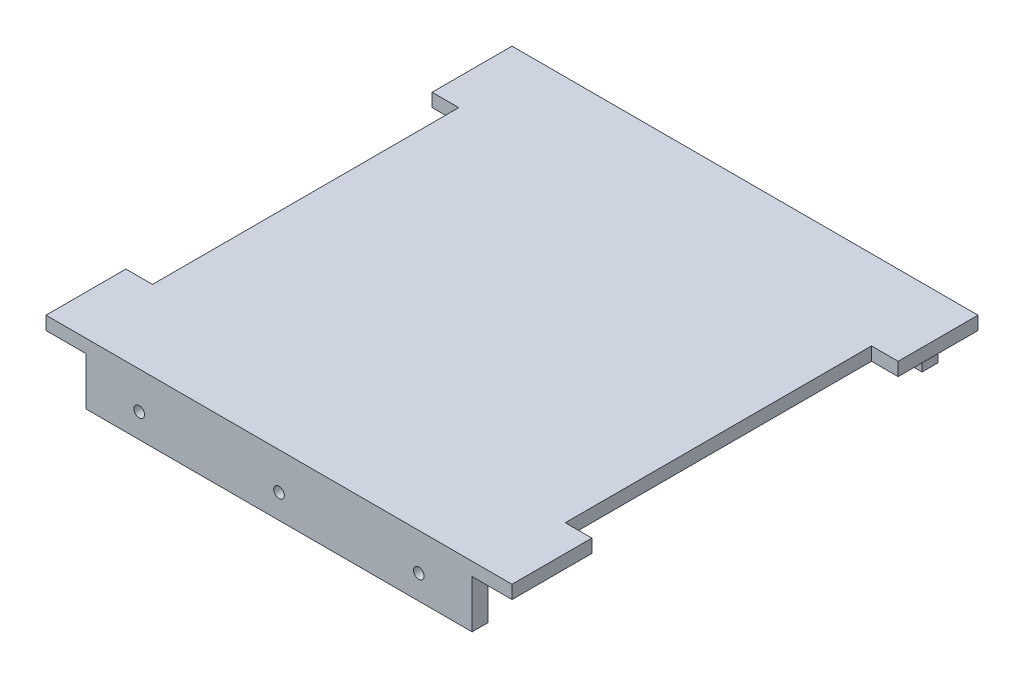
ISO-10303-21;
HEADER;
FILE_DESCRIPTION(('STEP AP214'),'2;1');
FILE_NAME('part.step','',(''),(''),'','','');
FILE_SCHEMA(('AUTOMOTIVE_DESIGN { 1 0 10303 214 1 1 1 1 }'));
ENDSEC;
DATA;
#1=APPLICATION_CONTEXT('core data for automotive mechanical design processes');
#2=APPLICATION_PROTOCOL_DEFINITION('international standard','automotive_design',2000,#1);
#3=PRODUCT_CONTEXT('',#1,'mechanical');
#4=PRODUCT('Part','Part','',(#3));
#5=PRODUCT_RELATED_PRODUCT_CATEGORY('part','',(#4));
#6=PRODUCT_DEFINITION_FORMATION('','',#4);
#7=PRODUCT_DEFINITION_CONTEXT('part definition',#1,'design');
#8=PRODUCT_DEFINITION('design','',#6,#7);
#9=PRODUCT_DEFINITION_SHAPE('','',#8);
#10=(LENGTH_UNIT() NAMED_UNIT(*) SI_UNIT(.MILLI.,.METRE.));
#11=(NAMED_UNIT(*) PLANE_ANGLE_UNIT() SI_UNIT($,.RADIAN.));
#12=(NAMED_UNIT(*) SI_UNIT($,.STERADIAN.) SOLID_ANGLE_UNIT());
#13=UNCERTAINTY_MEASURE_WITH_UNIT(LENGTH_MEASURE(1.E-05),#10,'distance_accuracy_value','');
#14=(GEOMETRIC_REPRESENTATION_CONTEXT(3) GLOBAL_UNCERTAINTY_ASSIGNED_CONTEXT((#13)) GLOBAL_UNIT_ASSIGNED_CONTEXT((#10,
#11,#12)) REPRESENTATION_CONTEXT('',''));
#15=CARTESIAN_POINT('',(0.,0.,0.));
#16=DIRECTION('',(0.,0.,1.));
#17=DIRECTION('',(1.,0.,0.));
#18=AXIS2_PLACEMENT_3D('',#15,#16,#17);
#19=CARTESIAN_POINT('',(-111.545801526718,5.,-60.1145038167939));
#20=DIRECTION('',(1.,0.,0.));
#21=DIRECTION('',(0.,0.,-1.));
#22=AXIS2_PLACEMENT_3D('',#19,#20,#21);
#23=PLANE('',#22);
#24=DIRECTION('',(0.,0.,1.));
#25=VECTOR('',#24,1.);
#26=CARTESIAN_POINT('',(-111.545801526718,0.,-60.1145038167939));
#27=LINE('',#26,#25);
#28=CARTESIAN_POINT('',(-111.545801526718,0.,-60.1145038167939));
#29=VERTEX_POINT('',#28);
#30=CARTESIAN_POINT('',(-111.545801526718,0.,-30.1145038167939));
#31=VERTEX_POINT('',#30);
#32=EDGE_CURVE('E329',#29,#31,#27,.T.);
#33=ORIENTED_EDGE('',*,*,#32,.T.);
#34=DIRECTION('',(0.,1.,0.));
#35=VECTOR('',#34,1.);
#36=CARTESIAN_POINT('',(-111.545801526718,-5.,-30.1145038167939));
#37=LINE('',#36,#35);
#38=CARTESIAN_POINT('',(-111.545801526718,5.,-30.1145038167939));
#39=VERTEX_POINT('',#38);
#40=EDGE_CURVE('E197',#31,#39,#37,.T.);
#41=ORIENTED_EDGE('',*,*,#40,.T.);
#42=DIRECTION('',(0.,0.,1.));
#43=VECTOR('',#42,1.);
#44=CARTESIAN_POINT('',(-111.545801526718,5.,-60.1145038167939));
#45=LINE('',#44,#43);
#46=CARTESIAN_POINT('',(-111.545801526718,5.,-60.1145038167939));
#47=VERTEX_POINT('',#46);
#48=EDGE_CURVE('E317',#47,#39,#45,.T.);
#49=ORIENTED_EDGE('',*,*,#48,.F.);
#50=DIRECTION('',(0.,-1.,0.));
#51=VECTOR('',#50,1.);
#52=CARTESIAN_POINT('',(-111.545801526718,5.,-60.1145038167939));
#53=LINE('',#52,#51);
#54=EDGE_CURVE('E328',#47,#29,#53,.T.);
#55=ORIENTED_EDGE('',*,*,#54,.T.);
#56=EDGE_LOOP('',(#33,#41,#49,#55));
#57=FACE_BOUND('',#56,.T.);
#58=ADVANCED_FACE('F33',(#57),#23,.F.);
#59=CARTESIAN_POINT('',(63.4541984732824,5.,-60.1145038167939));
#60=DIRECTION('',(-1.,0.,0.));
#61=DIRECTION('',(0.,0.,1.));
#62=AXIS2_PLACEMENT_3D('',#59,#60,#61);
#63=PLANE('',#62);
#64=DIRECTION('',(0.,0.,-1.));
#65=VECTOR('',#64,1.);
#66=CARTESIAN_POINT('',(63.4541984732824,0.,-60.1145038167939));
#67=LINE('',#66,#65);
#68=CARTESIAN_POINT('',(63.4541984732824,0.,114.885496183206));
#69=VERTEX_POINT('',#68);
#70=CARTESIAN_POINT('',(63.4541984732824,0.,84.8854961832061));
#71=VERTEX_POINT('',#70);
#72=EDGE_CURVE('E337',#69,#71,#67,.T.);
#73=ORIENTED_EDGE('',*,*,#72,.T.);
#74=DIRECTION('',(0.,1.,0.));
#75=VECTOR('',#74,1.);
#76=CARTESIAN_POINT('',(63.4541984732824,-5.,84.8854961832061));
#77=LINE('',#76,#75);
#78=CARTESIAN_POINT('',(63.4541984732824,5.,84.8854961832061));
#79=VERTEX_POINT('',#78);
#80=EDGE_CURVE('E189',#71,#79,#77,.T.);
#81=ORIENTED_EDGE('',*,*,#80,.T.);
#82=DIRECTION('',(0.,0.,-1.));
#83=VECTOR('',#82,1.);
#84=CARTESIAN_POINT('',(63.4541984732824,5.,-60.1145038167939));
#85=LINE('',#84,#83);
#86=CARTESIAN_POINT('',(63.4541984732824,5.,114.885496183206));
#87=VERTEX_POINT('',#86);
#88=EDGE_CURVE('E323',#87,#79,#85,.T.);
#89=ORIENTED_EDGE('',*,*,#88,.F.);
#90=DIRECTION('',(0.,-1.,0.));
#91=VECTOR('',#90,1.);
#92=CARTESIAN_POINT('',(63.4541984732824,5.,114.885496183206));
#93=LINE('',#92,#91);
#94=EDGE_CURVE('E42',#87,#69,#93,.T.);
#95=ORIENTED_EDGE('',*,*,#94,.T.);
#96=EDGE_LOOP('',(#73,#81,#89,#95));
#97=FACE_BOUND('',#96,.T.);
#98=ADVANCED_FACE('F408',(#97),#63,.F.);
#99=CARTESIAN_POINT('',(0.,0.,0.));
#100=DIRECTION('',(0.,1.,0.));
#101=DIRECTION('',(0.,0.,1.));
#102=AXIS2_PLACEMENT_3D('',#99,#100,#101);
#103=PLANE('',#102);
#104=DIRECTION('',(0.,0.,-1.));
#105=VECTOR('',#104,1.);
#106=CARTESIAN_POINT('',(-101.545801526718,0.,0.));
#107=LINE('',#106,#105);
#108=CARTESIAN_POINT('',(-101.545801526718,0.,84.8854961832061));
#109=VERTEX_POINT('',#108);
#110=CARTESIAN_POINT('',(-101.545801526718,0.,-30.1145038167939));
#111=VERTEX_POINT('',#110);
#112=EDGE_CURVE('E181',#109,#111,#107,.T.);
#113=ORIENTED_EDGE('',*,*,#112,.T.);
#114=DIRECTION('',(-1.,0.,0.));
#115=VECTOR('',#114,1.);
#116=CARTESIAN_POINT('',(0.,0.,-30.1145038167939));
#117=LINE('',#116,#115);
#118=EDGE_CURVE('E228',#111,#31,#117,.T.);
#119=ORIENTED_EDGE('',*,*,#118,.T.);
#120=ORIENTED_EDGE('',*,*,#32,.F.);
#121=DIRECTION('',(-1.,0.,0.));
#122=VECTOR('',#121,1.);
#123=CARTESIAN_POINT('',(-111.545801526718,0.,-60.1145038167939));
#124=LINE('',#123,#122);
#125=CARTESIAN_POINT('',(-96.5458015267176,0.,-60.1145038167939));
#126=VERTEX_POINT('',#125);
#127=EDGE_CURVE('E340',#126,#29,#124,.T.);
#128=ORIENTED_EDGE('',*,*,#127,.F.);
#129=DIRECTION('',(0.,0.,-1.));
#130=VECTOR('',#129,1.);
#131=CARTESIAN_POINT('',(-96.5458015267176,0.,-60.1145038167939));
#132=LINE('',#131,#130);
#133=CARTESIAN_POINT('',(-96.5458015267176,0.,-54.1145038167939));
#134=VERTEX_POINT('',#133);
#135=EDGE_CURVE('E260',#134,#126,#132,.T.);
#136=ORIENTED_EDGE('',*,*,#135,.F.);
#137=DIRECTION('',(-1.,0.,0.));
#138=VECTOR('',#137,1.);
#139=CARTESIAN_POINT('',(-96.5458015267176,0.,-54.1145038167939));
#140=LINE('',#139,#138);
#141=CARTESIAN_POINT('',(48.4541984732824,0.,-54.1145038167939));
#142=VERTEX_POINT('',#141);
#143=EDGE_CURVE('E265',#142,#134,#140,.T.);
#144=ORIENTED_EDGE('',*,*,#143,.F.);
#145=DIRECTION('',(0.,0.,1.));
#146=VECTOR('',#145,1.);
#147=CARTESIAN_POINT('',(48.4541984732824,0.,-60.1145038167939));
#148=LINE('',#147,#146);
#149=CARTESIAN_POINT('',(48.4541984732824,0.,-60.1145038167939));
#150=VERTEX_POINT('',#149);
#151=EDGE_CURVE('E273',#150,#142,#148,.T.);
#152=ORIENTED_EDGE('',*,*,#151,.F.);
#153=CARTESIAN_POINT('',(63.4541984732824,0.,-60.1145038167939));
#154=VERTEX_POINT('',#153);
#155=EDGE_CURVE('E341',#154,#150,#124,.T.);
#156=ORIENTED_EDGE('',*,*,#155,.F.);
#157=CARTESIAN_POINT('',(63.4541984732824,0.,-30.1145038167939));
#158=VERTEX_POINT('',#157);
#159=EDGE_CURVE('E336',#158,#154,#67,.T.);
#160=ORIENTED_EDGE('',*,*,#159,.F.);
#161=DIRECTION('',(-1.,0.,0.));
#162=VECTOR('',#161,1.);
#163=CARTESIAN_POINT('',(0.,0.,-30.1145038167939));
#164=LINE('',#163,#162);
#165=CARTESIAN_POINT('',(53.4541984732824,0.,-30.1145038167939));
#166=VERTEX_POINT('',#165);
#167=EDGE_CURVE('E200',#158,#166,#164,.T.);
#168=ORIENTED_EDGE('',*,*,#167,.T.);
#169=DIRECTION('',(0.,0.,1.));
#170=VECTOR('',#169,1.);
#171=CARTESIAN_POINT('',(53.4541984732824,0.,0.));
#172=LINE('',#171,#170);
#173=CARTESIAN_POINT('',(53.4541984732824,0.,84.8854961832061));
#174=VERTEX_POINT('',#173);
#175=EDGE_CURVE('E219',#166,#174,#172,.T.);
#176=ORIENTED_EDGE('',*,*,#175,.T.);
#177=DIRECTION('',(1.,0.,0.));
#178=VECTOR('',#177,1.);
#179=CARTESIAN_POINT('',(0.,0.,84.8854961832061));
#180=LINE('',#179,#178);
#181=EDGE_CURVE('E222',#174,#71,#180,.T.);
#182=ORIENTED_EDGE('',*,*,#181,.T.);
#183=ORIENTED_EDGE('',*,*,#72,.F.);
#184=DIRECTION('',(1.,0.,0.));
#185=VECTOR('',#184,1.);
#186=CARTESIAN_POINT('',(-111.545801526718,0.,114.885496183206));
#187=LINE('',#186,#185);
#188=CARTESIAN_POINT('',(48.4541984732824,0.,114.885496183206));
#189=VERTEX_POINT('',#188);
#190=EDGE_CURVE('E332',#189,#69,#187,.T.);
#191=ORIENTED_EDGE('',*,*,#190,.F.);
#192=DIRECTION('',(0.,0.,1.));
#193=VECTOR('',#192,1.);
#194=CARTESIAN_POINT('',(48.4541984732824,0.,114.885496183206));
#195=LINE('',#194,#193);
#196=CARTESIAN_POINT('',(48.4541984732824,0.,108.885496183206));
#197=VERTEX_POINT('',#196);
#198=EDGE_CURVE('E291',#197,#189,#195,.T.);
#199=ORIENTED_EDGE('',*,*,#198,.F.);
#200=DIRECTION('',(1.,0.,0.));
#201=VECTOR('',#200,1.);
#202=CARTESIAN_POINT('',(-96.5458015267176,0.,108.885496183206));
#203=LINE('',#202,#201);
#204=CARTESIAN_POINT('',(-96.5458015267176,0.,108.885496183206));
#205=VERTEX_POINT('',#204);
#206=EDGE_CURVE('E300',#205,#197,#203,.T.);
#207=ORIENTED_EDGE('',*,*,#206,.F.);
#208=DIRECTION('',(0.,0.,-1.));
#209=VECTOR('',#208,1.);
#210=CARTESIAN_POINT('',(-96.5458015267176,0.,114.885496183206));
#211=LINE('',#210,#209);
#212=CARTESIAN_POINT('',(-96.5458015267176,0.,114.885496183206));
#213=VERTEX_POINT('',#212);
#214=EDGE_CURVE('E286',#213,#205,#211,.T.);
#215=ORIENTED_EDGE('',*,*,#214,.F.);
#216=CARTESIAN_POINT('',(-111.545801526718,0.,114.885496183206));
#217=VERTEX_POINT('',#216);
#218=EDGE_CURVE('E333',#217,#213,#187,.T.);
#219=ORIENTED_EDGE('',*,*,#218,.F.);
#220=CARTESIAN_POINT('',(-111.545801526718,0.,84.8854961832061));
#221=VERTEX_POINT('',#220);
#222=EDGE_CURVE('E316',#221,#217,#27,.T.);
#223=ORIENTED_EDGE('',*,*,#222,.F.);
#224=DIRECTION('',(1.,0.,0.));
#225=VECTOR('',#224,1.);
#226=CARTESIAN_POINT('',(0.,0.,84.8854961832061));
#227=LINE('',#226,#225);
#228=EDGE_CURVE('E225',#221,#109,#227,.T.);
#229=ORIENTED_EDGE('',*,*,#228,.T.);
#230=EDGE_LOOP('',(#113,#119,#120,#128,#136,#144,#152,#156,#160,#168,#176,#182,#183,#191,#199,
#207,#215,#219,#223,#229));
#231=FACE_BOUND('',#230,.T.);
#232=ADVANCED_FACE('F383',(#231),#103,.F.);
#233=CARTESIAN_POINT('',(-111.545801526718,5.,84.8854961832061));
#234=VERTEX_POINT('',#233);
#235=CARTESIAN_POINT('',(-111.545801526718,5.,114.885496183206));
#236=VERTEX_POINT('',#235);
#237=EDGE_CURVE('E320',#234,#236,#45,.T.);
#238=ORIENTED_EDGE('',*,*,#237,.F.);
#239=DIRECTION('',(0.,1.,0.));
#240=VECTOR('',#239,1.);
#241=CARTESIAN_POINT('',(-111.545801526718,-5.,84.8854961832061));
#242=LINE('',#241,#240);
#243=EDGE_CURVE('E58',#221,#234,#242,.T.);
#244=ORIENTED_EDGE('',*,*,#243,.F.);
#245=ORIENTED_EDGE('',*,*,#222,.T.);
#246=DIRECTION('',(0.,-1.,0.));
#247=VECTOR('',#246,1.);
#248=CARTESIAN_POINT('',(-111.545801526718,5.,114.885496183206));
#249=LINE('',#248,#247);
#250=EDGE_CURVE('E11',#236,#217,#249,.T.);
#251=ORIENTED_EDGE('',*,*,#250,.F.);
#252=EDGE_LOOP('',(#238,#244,#245,#251));
#253=FACE_BOUND('',#252,.T.);
#254=ADVANCED_FACE('F35',(#253),#23,.F.);
#255=CARTESIAN_POINT('',(-111.545801526718,5.,114.885496183206));
#256=DIRECTION('',(0.,0.,-1.));
#257=DIRECTION('',(-1.,0.,0.));
#258=AXIS2_PLACEMENT_3D('',#255,#256,#257);
#259=PLANE('',#258);
#260=CARTESIAN_POINT('',(28.4541984732824,-8.90083287186272,114.885496183206));
#261=DIRECTION('',(0.,0.,-1.));
#262=DIRECTION('',(-1.,0.,0.));
#263=AXIS2_PLACEMENT_3D('',#260,#261,#262);
#264=CIRCLE('',#263,2.);
#265=CARTESIAN_POINT('',(26.4541984732824,-8.90083287186272,114.885496183206));
#266=VERTEX_POINT('',#265);
#267=EDGE_CURVE('E232',#266,#266,#264,.T.);
#268=ORIENTED_EDGE('',*,*,#267,.T.);
#269=EDGE_LOOP('',(#268));
#270=FACE_BOUND('',#269,.T.);
#271=CARTESIAN_POINT('',(-24.0458015267176,-8.90083287186272,114.885496183206));
#272=DIRECTION('',(0.,0.,-1.));
#273=DIRECTION('',(-1.,0.,0.));
#274=AXIS2_PLACEMENT_3D('',#271,#272,#273);
#275=CIRCLE('',#274,2.);
#276=CARTESIAN_POINT('',(-26.0458015267176,-8.90083287186272,114.885496183206));
#277=VERTEX_POINT('',#276);
#278=EDGE_CURVE('E236',#277,#277,#275,.T.);
#279=ORIENTED_EDGE('',*,*,#278,.T.);
#280=EDGE_LOOP('',(#279));
#281=FACE_BOUND('',#280,.T.);
#282=CARTESIAN_POINT('',(-76.5458015267176,-8.90083287186272,114.885496183206));
#283=DIRECTION('',(0.,0.,-1.));
#284=DIRECTION('',(-1.,0.,0.));
#285=AXIS2_PLACEMENT_3D('',#282,#283,#284);
#286=CIRCLE('',#285,2.);
#287=CARTESIAN_POINT('',(-78.5458015267176,-8.90083287186272,114.885496183206));
#288=VERTEX_POINT('',#287);
#289=EDGE_CURVE('E231',#288,#288,#286,.T.);
#290=ORIENTED_EDGE('',*,*,#289,.T.);
#291=EDGE_LOOP('',(#290));
#292=FACE_BOUND('',#291,.T.);
#293=ORIENTED_EDGE('',*,*,#218,.T.);
#294=DIRECTION('',(0.,1.,0.));
#295=VECTOR('',#294,1.);
#296=CARTESIAN_POINT('',(-96.5458015267176,-18.,114.885496183206));
#297=LINE('',#296,#295);
#298=CARTESIAN_POINT('',(-96.5458015267176,-18.,114.885496183206));
#299=VERTEX_POINT('',#298);
#300=EDGE_CURVE('E297',#299,#213,#297,.T.);
#301=ORIENTED_EDGE('',*,*,#300,.F.);
#302=DIRECTION('',(-1.,0.,0.));
#303=VECTOR('',#302,1.);
#304=CARTESIAN_POINT('',(-96.5458015267176,-18.,114.885496183206));
#305=LINE('',#304,#303);
#306=CARTESIAN_POINT('',(48.4541984732824,-18.,114.885496183206));
#307=VERTEX_POINT('',#306);
#308=EDGE_CURVE('E295',#307,#299,#305,.T.);
#309=ORIENTED_EDGE('',*,*,#308,.F.);
#310=DIRECTION('',(0.,1.,0.));
#311=VECTOR('',#310,1.);
#312=CARTESIAN_POINT('',(48.4541984732824,-18.,114.885496183206));
#313=LINE('',#312,#311);
#314=EDGE_CURVE('E307',#307,#189,#313,.T.);
#315=ORIENTED_EDGE('',*,*,#314,.T.);
#316=ORIENTED_EDGE('',*,*,#190,.T.);
#317=ORIENTED_EDGE('',*,*,#94,.F.);
#318=DIRECTION('',(1.,0.,0.));
#319=VECTOR('',#318,1.);
#320=CARTESIAN_POINT('',(-111.545801526718,5.,114.885496183206));
#321=LINE('',#320,#319);
#322=EDGE_CURVE('E319',#236,#87,#321,.T.);
#323=ORIENTED_EDGE('',*,*,#322,.F.);
#324=ORIENTED_EDGE('',*,*,#250,.T.);
#325=EDGE_LOOP('',(#293,#301,#309,#315,#316,#317,#323,#324));
#326=FACE_BOUND('',#325,.T.);
#327=ADVANCED_FACE('F406',(#270,#281,#292,#326),#259,.F.);
#328=CARTESIAN_POINT('',(63.4541984732824,5.,-30.1145038167939));
#329=VERTEX_POINT('',#328);
#330=CARTESIAN_POINT('',(63.4541984732824,5.,-60.1145038167939));
#331=VERTEX_POINT('',#330);
#332=EDGE_CURVE('E322',#329,#331,#85,.T.);
#333=ORIENTED_EDGE('',*,*,#332,.F.);
#334=DIRECTION('',(0.,1.,0.));
#335=VECTOR('',#334,1.);
#336=CARTESIAN_POINT('',(63.4541984732824,-5.,-30.1145038167939));
#337=LINE('',#336,#335);
#338=EDGE_CURVE('E50',#158,#329,#337,.T.);
#339=ORIENTED_EDGE('',*,*,#338,.F.);
#340=ORIENTED_EDGE('',*,*,#159,.T.);
#341=DIRECTION('',(0.,-1.,0.));
#342=VECTOR('',#341,1.);
#343=CARTESIAN_POINT('',(63.4541984732824,5.,-60.1145038167939));
#344=LINE('',#343,#342);
#345=EDGE_CURVE('E346',#331,#154,#344,.T.);
#346=ORIENTED_EDGE('',*,*,#345,.F.);
#347=EDGE_LOOP('',(#333,#339,#340,#346));
#348=FACE_BOUND('',#347,.T.);
#349=ADVANCED_FACE('F370',(#348),#63,.F.);
#350=CARTESIAN_POINT('',(-111.545801526718,5.,-60.1145038167939));
#351=DIRECTION('',(0.,0.,1.));
#352=DIRECTION('',(1.,0.,0.));
#353=AXIS2_PLACEMENT_3D('',#350,#351,#352);
#354=PLANE('',#353);
#355=CARTESIAN_POINT('',(28.4541984732824,-8.90083287186272,-60.1145038167939));
#356=DIRECTION('',(0.,0.,1.));
#357=DIRECTION('',(1.,0.,0.));
#358=AXIS2_PLACEMENT_3D('',#355,#356,#357);
#359=CIRCLE('',#358,2.);
#360=CARTESIAN_POINT('',(30.4541984732824,-8.90083287186272,-60.1145038167939));
#361=VERTEX_POINT('',#360);
#362=EDGE_CURVE('E257',#361,#361,#359,.T.);
#363=ORIENTED_EDGE('',*,*,#362,.T.);
#364=EDGE_LOOP('',(#363));
#365=FACE_BOUND('',#364,.T.);
#366=CARTESIAN_POINT('',(-24.0458015267176,-8.90083287186272,-60.1145038167939));
#367=DIRECTION('',(0.,0.,1.));
#368=DIRECTION('',(1.,0.,0.));
#369=AXIS2_PLACEMENT_3D('',#366,#367,#368);
#370=CIRCLE('',#369,2.);
#371=CARTESIAN_POINT('',(-22.0458015267176,-8.90083287186272,-60.1145038167939));
#372=VERTEX_POINT('',#371);
#373=EDGE_CURVE('E251',#372,#372,#370,.T.);
#374=ORIENTED_EDGE('',*,*,#373,.T.);
#375=EDGE_LOOP('',(#374));
#376=FACE_BOUND('',#375,.T.);
#377=CARTESIAN_POINT('',(-76.5458015267176,-8.90083287186272,-60.1145038167939));
#378=DIRECTION('',(0.,0.,1.));
#379=DIRECTION('',(1.,0.,0.));
#380=AXIS2_PLACEMENT_3D('',#377,#378,#379);
#381=CIRCLE('',#380,2.);
#382=CARTESIAN_POINT('',(-74.5458015267176,-8.90083287186272,-60.1145038167939));
#383=VERTEX_POINT('',#382);
#384=EDGE_CURVE('E244',#383,#383,#381,.T.);
#385=ORIENTED_EDGE('',*,*,#384,.T.);
#386=EDGE_LOOP('',(#385));
#387=FACE_BOUND('',#386,.T.);
#388=ORIENTED_EDGE('',*,*,#155,.T.);
#389=DIRECTION('',(0.,1.,0.));
#390=VECTOR('',#389,1.);
#391=CARTESIAN_POINT('',(48.4541984732824,-18.,-60.1145038167939));
#392=LINE('',#391,#390);
#393=CARTESIAN_POINT('',(48.4541984732824,-18.,-60.1145038167939));
#394=VERTEX_POINT('',#393);
#395=EDGE_CURVE('E281',#394,#150,#392,.T.);
#396=ORIENTED_EDGE('',*,*,#395,.F.);
#397=DIRECTION('',(1.,0.,0.));
#398=VECTOR('',#397,1.);
#399=CARTESIAN_POINT('',(-96.5458015267176,-18.,-60.1145038167939));
#400=LINE('',#399,#398);
#401=CARTESIAN_POINT('',(-96.5458015267176,-18.,-60.1145038167939));
#402=VERTEX_POINT('',#401);
#403=EDGE_CURVE('E264',#402,#394,#400,.T.);
#404=ORIENTED_EDGE('',*,*,#403,.F.);
#405=DIRECTION('',(0.,1.,0.));
#406=VECTOR('',#405,1.);
#407=CARTESIAN_POINT('',(-96.5458015267176,-18.,-60.1145038167939));
#408=LINE('',#407,#406);
#409=EDGE_CURVE('E283',#402,#126,#408,.T.);
#410=ORIENTED_EDGE('',*,*,#409,.T.);
#411=ORIENTED_EDGE('',*,*,#127,.T.);
#412=ORIENTED_EDGE('',*,*,#54,.F.);
#413=DIRECTION('',(-1.,0.,0.));
#414=VECTOR('',#413,1.);
#415=CARTESIAN_POINT('',(-111.545801526718,5.,-60.1145038167939));
#416=LINE('',#415,#414);
#417=EDGE_CURVE('E326',#331,#47,#416,.T.);
#418=ORIENTED_EDGE('',*,*,#417,.F.);
#419=ORIENTED_EDGE('',*,*,#345,.T.);
#420=EDGE_LOOP('',(#388,#396,#404,#410,#411,#412,#418,#419));
#421=FACE_BOUND('',#420,.T.);
#422=ADVANCED_FACE('F367',(#365,#376,#387,#421),#354,.F.);
#423=CARTESIAN_POINT('',(0.,5.,0.));
#424=DIRECTION('',(0.,1.,0.));
#425=DIRECTION('',(0.,0.,1.));
#426=AXIS2_PLACEMENT_3D('',#423,#424,#425);
#427=PLANE('',#426);
#428=DIRECTION('',(-1.,0.,0.));
#429=VECTOR('',#428,1.);
#430=CARTESIAN_POINT('',(-111.545801526718,5.,-30.1145038167939));
#431=LINE('',#430,#429);
#432=CARTESIAN_POINT('',(-101.545801526718,5.,-30.1145038167939));
#433=VERTEX_POINT('',#432);
#434=EDGE_CURVE('E193',#433,#39,#431,.T.);
#435=ORIENTED_EDGE('',*,*,#434,.F.);
#436=DIRECTION('',(0.,0.,-1.));
#437=VECTOR('',#436,1.);
#438=CARTESIAN_POINT('',(-101.545801526718,5.,-30.1145038167939));
#439=LINE('',#438,#437);
#440=CARTESIAN_POINT('',(-101.545801526718,5.,84.8854961832061));
#441=VERTEX_POINT('',#440);
#442=EDGE_CURVE('E178',#441,#433,#439,.T.);
#443=ORIENTED_EDGE('',*,*,#442,.F.);
#444=DIRECTION('',(1.,0.,0.));
#445=VECTOR('',#444,1.);
#446=CARTESIAN_POINT('',(-111.545801526718,5.,84.8854961832061));
#447=LINE('',#446,#445);
#448=EDGE_CURVE('E185',#234,#441,#447,.T.);
#449=ORIENTED_EDGE('',*,*,#448,.F.);
#450=ORIENTED_EDGE('',*,*,#237,.T.);
#451=ORIENTED_EDGE('',*,*,#322,.T.);
#452=ORIENTED_EDGE('',*,*,#88,.T.);
#453=DIRECTION('',(1.,0.,0.));
#454=VECTOR('',#453,1.);
#455=CARTESIAN_POINT('',(63.4541984732824,5.,84.8854961832061));
#456=LINE('',#455,#454);
#457=CARTESIAN_POINT('',(53.4541984732824,5.,84.8854961832061));
#458=VERTEX_POINT('',#457);
#459=EDGE_CURVE('E208',#458,#79,#456,.T.);
#460=ORIENTED_EDGE('',*,*,#459,.F.);
#461=DIRECTION('',(0.,0.,1.));
#462=VECTOR('',#461,1.);
#463=CARTESIAN_POINT('',(53.4541984732824,5.,-30.1145038167939));
#464=LINE('',#463,#462);
#465=CARTESIAN_POINT('',(53.4541984732824,5.,-30.1145038167939));
#466=VERTEX_POINT('',#465);
#467=EDGE_CURVE('E205',#466,#458,#464,.T.);
#468=ORIENTED_EDGE('',*,*,#467,.F.);
#469=DIRECTION('',(-1.,0.,0.));
#470=VECTOR('',#469,1.);
#471=CARTESIAN_POINT('',(63.4541984732824,5.,-30.1145038167939));
#472=LINE('',#471,#470);
#473=EDGE_CURVE('E203',#329,#466,#472,.T.);
#474=ORIENTED_EDGE('',*,*,#473,.F.);
#475=ORIENTED_EDGE('',*,*,#332,.T.);
#476=ORIENTED_EDGE('',*,*,#417,.T.);
#477=ORIENTED_EDGE('',*,*,#48,.T.);
#478=EDGE_LOOP('',(#435,#443,#449,#450,#451,#452,#460,#468,#474,#475,#476,#477));
#479=FACE_BOUND('',#478,.T.);
#480=ADVANCED_FACE('F191',(#479),#427,.T.);
#481=CARTESIAN_POINT('',(-96.5458015267176,-18.,114.885496183206));
#482=DIRECTION('',(1.,0.,0.));
#483=DIRECTION('',(0.,0.,-1.));
#484=AXIS2_PLACEMENT_3D('',#481,#482,#483);
#485=PLANE('',#484);
#486=ORIENTED_EDGE('',*,*,#214,.T.);
#487=DIRECTION('',(0.,1.,0.));
#488=VECTOR('',#487,1.);
#489=CARTESIAN_POINT('',(-96.5458015267176,-18.,108.885496183206));
#490=LINE('',#489,#488);
#491=CARTESIAN_POINT('',(-96.5458015267176,-18.,108.885496183206));
#492=VERTEX_POINT('',#491);
#493=EDGE_CURVE('E313',#492,#205,#490,.T.);
#494=ORIENTED_EDGE('',*,*,#493,.F.);
#495=DIRECTION('',(0.,0.,-1.));
#496=VECTOR('',#495,1.);
#497=CARTESIAN_POINT('',(-96.5458015267176,-18.,114.885496183206));
#498=LINE('',#497,#496);
#499=EDGE_CURVE('E287',#299,#492,#498,.T.);
#500=ORIENTED_EDGE('',*,*,#499,.F.);
#501=ORIENTED_EDGE('',*,*,#300,.T.);
#502=EDGE_LOOP('',(#486,#494,#500,#501));
#503=FACE_BOUND('',#502,.T.);
#504=ADVANCED_FACE('F480',(#503),#485,.F.);
#505=CARTESIAN_POINT('',(-96.5458015267176,-18.,108.885496183206));
#506=DIRECTION('',(0.,0.,1.));
#507=DIRECTION('',(1.,0.,0.));
#508=AXIS2_PLACEMENT_3D('',#505,#506,#507);
#509=PLANE('',#508);
#510=CARTESIAN_POINT('',(28.4541984732824,-8.90083287186272,108.885496183206));
#511=DIRECTION('',(0.,0.,1.));
#512=DIRECTION('',(1.,0.,0.));
#513=AXIS2_PLACEMENT_3D('',#510,#511,#512);
#514=CIRCLE('',#513,2.);
#515=CARTESIAN_POINT('',(30.4541984732824,-8.90083287186272,108.885496183206));
#516=VERTEX_POINT('',#515);
#517=EDGE_CURVE('E254',#516,#516,#514,.T.);
#518=ORIENTED_EDGE('',*,*,#517,.T.);
#519=EDGE_LOOP('',(#518));
#520=FACE_BOUND('',#519,.T.);
#521=CARTESIAN_POINT('',(-24.0458015267176,-8.90083287186272,108.885496183206));
#522=DIRECTION('',(0.,0.,1.));
#523=DIRECTION('',(1.,0.,0.));
#524=AXIS2_PLACEMENT_3D('',#521,#522,#523);
#525=CIRCLE('',#524,2.);
#526=CARTESIAN_POINT('',(-22.0458015267176,-8.90083287186272,108.885496183206));
#527=VERTEX_POINT('',#526);
#528=EDGE_CURVE('E248',#527,#527,#525,.T.);
#529=ORIENTED_EDGE('',*,*,#528,.T.);
#530=EDGE_LOOP('',(#529));
#531=FACE_BOUND('',#530,.T.);
#532=CARTESIAN_POINT('',(-76.5458015267176,-8.90083287186272,108.885496183206));
#533=DIRECTION('',(0.,0.,1.));
#534=DIRECTION('',(1.,0.,0.));
#535=AXIS2_PLACEMENT_3D('',#532,#533,#534);
#536=CIRCLE('',#535,2.);
#537=CARTESIAN_POINT('',(-74.5458015267176,-8.90083287186272,108.885496183206));
#538=VERTEX_POINT('',#537);
#539=EDGE_CURVE('E241',#538,#538,#536,.T.);
#540=ORIENTED_EDGE('',*,*,#539,.T.);
#541=EDGE_LOOP('',(#540));
#542=FACE_BOUND('',#541,.T.);
#543=ORIENTED_EDGE('',*,*,#206,.T.);
#544=DIRECTION('',(0.,1.,0.));
#545=VECTOR('',#544,1.);
#546=CARTESIAN_POINT('',(48.4541984732824,-18.,108.885496183206));
#547=LINE('',#546,#545);
#548=CARTESIAN_POINT('',(48.4541984732824,-18.,108.885496183206));
#549=VERTEX_POINT('',#548);
#550=EDGE_CURVE('E310',#549,#197,#547,.T.);
#551=ORIENTED_EDGE('',*,*,#550,.F.);
#552=DIRECTION('',(1.,0.,0.));
#553=VECTOR('',#552,1.);
#554=CARTESIAN_POINT('',(-96.5458015267176,-18.,108.885496183206));
#555=LINE('',#554,#553);
#556=EDGE_CURVE('E290',#492,#549,#555,.T.);
#557=ORIENTED_EDGE('',*,*,#556,.F.);
#558=ORIENTED_EDGE('',*,*,#493,.T.);
#559=EDGE_LOOP('',(#543,#551,#557,#558));
#560=FACE_BOUND('',#559,.T.);
#561=ADVANCED_FACE('F476',(#520,#531,#542,#560),#509,.F.);
#562=CARTESIAN_POINT('',(48.4541984732824,-18.,114.885496183206));
#563=DIRECTION('',(-1.,0.,0.));
#564=DIRECTION('',(0.,0.,1.));
#565=AXIS2_PLACEMENT_3D('',#562,#563,#564);
#566=PLANE('',#565);
#567=ORIENTED_EDGE('',*,*,#198,.T.);
#568=ORIENTED_EDGE('',*,*,#314,.F.);
#569=DIRECTION('',(0.,0.,1.));
#570=VECTOR('',#569,1.);
#571=CARTESIAN_POINT('',(48.4541984732824,-18.,114.885496183206));
#572=LINE('',#571,#570);
#573=EDGE_CURVE('E293',#549,#307,#572,.T.);
#574=ORIENTED_EDGE('',*,*,#573,.F.);
#575=ORIENTED_EDGE('',*,*,#550,.T.);
#576=EDGE_LOOP('',(#567,#568,#574,#575));
#577=FACE_BOUND('',#576,.T.);
#578=ADVANCED_FACE('F472',(#577),#566,.F.);
#579=CARTESIAN_POINT('',(0.,-18.,0.));
#580=DIRECTION('',(0.,-1.,0.));
#581=DIRECTION('',(0.,0.,-1.));
#582=AXIS2_PLACEMENT_3D('',#579,#580,#581);
#583=PLANE('',#582);
#584=ORIENTED_EDGE('',*,*,#499,.T.);
#585=ORIENTED_EDGE('',*,*,#556,.T.);
#586=ORIENTED_EDGE('',*,*,#573,.T.);
#587=ORIENTED_EDGE('',*,*,#308,.T.);
#588=EDGE_LOOP('',(#584,#585,#586,#587));
#589=FACE_BOUND('',#588,.T.);
#590=ADVANCED_FACE('F469',(#589),#583,.T.);
#591=CARTESIAN_POINT('',(-96.5458015267176,-18.,-60.1145038167939));
#592=DIRECTION('',(1.,0.,0.));
#593=DIRECTION('',(0.,0.,-1.));
#594=AXIS2_PLACEMENT_3D('',#591,#592,#593);
#595=PLANE('',#594);
#596=ORIENTED_EDGE('',*,*,#135,.T.);
#597=ORIENTED_EDGE('',*,*,#409,.F.);
#598=DIRECTION('',(0.,0.,-1.));
#599=VECTOR('',#598,1.);
#600=CARTESIAN_POINT('',(-96.5458015267176,-18.,-60.1145038167939));
#601=LINE('',#600,#599);
#602=CARTESIAN_POINT('',(-96.5458015267176,-18.,-54.1145038167939));
#603=VERTEX_POINT('',#602);
#604=EDGE_CURVE('E261',#603,#402,#601,.T.);
#605=ORIENTED_EDGE('',*,*,#604,.F.);
#606=DIRECTION('',(0.,1.,0.));
#607=VECTOR('',#606,1.);
#608=CARTESIAN_POINT('',(-96.5458015267176,-18.,-54.1145038167939));
#609=LINE('',#608,#607);
#610=EDGE_CURVE('E271',#603,#134,#609,.T.);
#611=ORIENTED_EDGE('',*,*,#610,.T.);
#612=EDGE_LOOP('',(#596,#597,#605,#611));
#613=FACE_BOUND('',#612,.T.);
#614=ADVANCED_FACE('F466',(#613),#595,.F.);
#615=CARTESIAN_POINT('',(48.4541984732824,-18.,-60.1145038167939));
#616=DIRECTION('',(-1.,0.,0.));
#617=DIRECTION('',(0.,0.,1.));
#618=AXIS2_PLACEMENT_3D('',#615,#616,#617);
#619=PLANE('',#618);
#620=ORIENTED_EDGE('',*,*,#151,.T.);
#621=DIRECTION('',(0.,1.,0.));
#622=VECTOR('',#621,1.);
#623=CARTESIAN_POINT('',(48.4541984732824,-18.,-54.1145038167939));
#624=LINE('',#623,#622);
#625=CARTESIAN_POINT('',(48.4541984732824,-18.,-54.1145038167939));
#626=VERTEX_POINT('',#625);
#627=EDGE_CURVE('E278',#626,#142,#624,.T.);
#628=ORIENTED_EDGE('',*,*,#627,.F.);
#629=DIRECTION('',(0.,0.,1.));
#630=VECTOR('',#629,1.);
#631=CARTESIAN_POINT('',(48.4541984732824,-18.,-60.1145038167939));
#632=LINE('',#631,#630);
#633=EDGE_CURVE('E267',#394,#626,#632,.T.);
#634=ORIENTED_EDGE('',*,*,#633,.F.);
#635=ORIENTED_EDGE('',*,*,#395,.T.);
#636=EDGE_LOOP('',(#620,#628,#634,#635));
#637=FACE_BOUND('',#636,.T.);
#638=ADVANCED_FACE('F388',(#637),#619,.F.);
#639=CARTESIAN_POINT('',(-96.5458015267176,-18.,-54.1145038167939));
#640=DIRECTION('',(0.,0.,-1.));
#641=DIRECTION('',(-1.,0.,0.));
#642=AXIS2_PLACEMENT_3D('',#639,#640,#641);
#643=PLANE('',#642);
#644=CARTESIAN_POINT('',(28.4541984732824,-8.90083287186272,-54.1145038167939));
#645=DIRECTION('',(0.,0.,-1.));
#646=DIRECTION('',(-1.,0.,0.));
#647=AXIS2_PLACEMENT_3D('',#644,#645,#646);
#648=CIRCLE('',#647,2.);
#649=CARTESIAN_POINT('',(26.4541984732824,-8.90083287186272,-54.1145038167939));
#650=VERTEX_POINT('',#649);
#651=EDGE_CURVE('E37',#650,#650,#648,.T.);
#652=ORIENTED_EDGE('',*,*,#651,.T.);
#653=EDGE_LOOP('',(#652));
#654=FACE_BOUND('',#653,.T.);
#655=CARTESIAN_POINT('',(-24.0458015267176,-8.90083287186272,-54.1145038167939));
#656=DIRECTION('',(0.,0.,-1.));
#657=DIRECTION('',(-1.,0.,0.));
#658=AXIS2_PLACEMENT_3D('',#655,#656,#657);
#659=CIRCLE('',#658,2.);
#660=CARTESIAN_POINT('',(-26.0458015267176,-8.90083287186272,-54.1145038167939));
#661=VERTEX_POINT('',#660);
#662=EDGE_CURVE('E247',#661,#661,#659,.T.);
#663=ORIENTED_EDGE('',*,*,#662,.T.);
#664=EDGE_LOOP('',(#663));
#665=FACE_BOUND('',#664,.T.);
#666=CARTESIAN_POINT('',(-76.5458015267176,-8.90083287186272,-54.1145038167939));
#667=DIRECTION('',(0.,0.,-1.));
#668=DIRECTION('',(-1.,0.,0.));
#669=AXIS2_PLACEMENT_3D('',#666,#667,#668);
#670=CIRCLE('',#669,2.);
#671=CARTESIAN_POINT('',(-78.5458015267176,-8.90083287186272,-54.1145038167939));
#672=VERTEX_POINT('',#671);
#673=EDGE_CURVE('E235',#672,#672,#670,.T.);
#674=ORIENTED_EDGE('',*,*,#673,.T.);
#675=EDGE_LOOP('',(#674));
#676=FACE_BOUND('',#675,.T.);
#677=ORIENTED_EDGE('',*,*,#143,.T.);
#678=ORIENTED_EDGE('',*,*,#610,.F.);
#679=DIRECTION('',(-1.,0.,0.));
#680=VECTOR('',#679,1.);
#681=CARTESIAN_POINT('',(-96.5458015267176,-18.,-54.1145038167939));
#682=LINE('',#681,#680);
#683=EDGE_CURVE('E269',#626,#603,#682,.T.);
#684=ORIENTED_EDGE('',*,*,#683,.F.);
#685=ORIENTED_EDGE('',*,*,#627,.T.);
#686=EDGE_LOOP('',(#677,#678,#684,#685));
#687=FACE_BOUND('',#686,.T.);
#688=ADVANCED_FACE('F355',(#654,#665,#676,#687),#643,.F.);
#689=CARTESIAN_POINT('',(0.,-18.,0.));
#690=DIRECTION('',(0.,1.,0.));
#691=DIRECTION('',(0.,0.,1.));
#692=AXIS2_PLACEMENT_3D('',#689,#690,#691);
#693=PLANE('',#692);
#694=ORIENTED_EDGE('',*,*,#604,.T.);
#695=ORIENTED_EDGE('',*,*,#403,.T.);
#696=ORIENTED_EDGE('',*,*,#633,.T.);
#697=ORIENTED_EDGE('',*,*,#683,.T.);
#698=EDGE_LOOP('',(#694,#695,#696,#697));
#699=FACE_BOUND('',#698,.T.);
#700=ADVANCED_FACE('F394',(#699),#693,.F.);
#701=CARTESIAN_POINT('',(-76.5458015267176,-8.90083287186272,114.885496183206));
#702=DIRECTION('',(0.,0.,-1.));
#703=DIRECTION('',(-1.,0.,0.));
#704=AXIS2_PLACEMENT_3D('',#701,#702,#703);
#705=CYLINDRICAL_SURFACE('',#704,2.);
#706=ORIENTED_EDGE('',*,*,#673,.F.);
#707=EDGE_LOOP('',(#706));
#708=FACE_BOUND('',#707,.T.);
#709=ORIENTED_EDGE('',*,*,#384,.F.);
#710=EDGE_LOOP('',(#709));
#711=FACE_BOUND('',#710,.T.);
#712=ADVANCED_FACE('F362',(#708,#711),#705,.F.);
#713=CARTESIAN_POINT('',(-24.0458015267176,-8.90083287186272,114.885496183206));
#714=DIRECTION('',(0.,0.,-1.));
#715=DIRECTION('',(-1.,0.,0.));
#716=AXIS2_PLACEMENT_3D('',#713,#714,#715);
#717=CYLINDRICAL_SURFACE('',#716,2.);
#718=ORIENTED_EDGE('',*,*,#662,.F.);
#719=EDGE_LOOP('',(#718));
#720=FACE_BOUND('',#719,.T.);
#721=ORIENTED_EDGE('',*,*,#373,.F.);
#722=EDGE_LOOP('',(#721));
#723=FACE_BOUND('',#722,.T.);
#724=ADVANCED_FACE('F358',(#720,#723),#717,.F.);
#725=CARTESIAN_POINT('',(28.4541984732824,-8.90083287186272,114.885496183206));
#726=DIRECTION('',(0.,0.,-1.));
#727=DIRECTION('',(-1.,0.,0.));
#728=AXIS2_PLACEMENT_3D('',#725,#726,#727);
#729=CYLINDRICAL_SURFACE('',#728,2.);
#730=ORIENTED_EDGE('',*,*,#651,.F.);
#731=EDGE_LOOP('',(#730));
#732=FACE_BOUND('',#731,.T.);
#733=ORIENTED_EDGE('',*,*,#362,.F.);
#734=EDGE_LOOP('',(#733));
#735=FACE_BOUND('',#734,.T.);
#736=ADVANCED_FACE('F361',(#732,#735),#729,.F.);
#737=ORIENTED_EDGE('',*,*,#289,.F.);
#738=EDGE_LOOP('',(#737));
#739=FACE_BOUND('',#738,.T.);
#740=ORIENTED_EDGE('',*,*,#539,.F.);
#741=EDGE_LOOP('',(#740));
#742=FACE_BOUND('',#741,.T.);
#743=ADVANCED_FACE('F452',(#739,#742),#705,.F.);
#744=ORIENTED_EDGE('',*,*,#278,.F.);
#745=EDGE_LOOP('',(#744));
#746=FACE_BOUND('',#745,.T.);
#747=ORIENTED_EDGE('',*,*,#528,.F.);
#748=EDGE_LOOP('',(#747));
#749=FACE_BOUND('',#748,.T.);
#750=ADVANCED_FACE('F364',(#746,#749),#717,.F.);
#751=ORIENTED_EDGE('',*,*,#267,.F.);
#752=EDGE_LOOP('',(#751));
#753=FACE_BOUND('',#752,.T.);
#754=ORIENTED_EDGE('',*,*,#517,.F.);
#755=EDGE_LOOP('',(#754));
#756=FACE_BOUND('',#755,.T.);
#757=ADVANCED_FACE('F454',(#753,#756),#729,.F.);
#758=CARTESIAN_POINT('',(63.4541984732824,-5.,84.8854961832061));
#759=DIRECTION('',(0.,0.,1.));
#760=DIRECTION('',(1.,0.,0.));
#761=AXIS2_PLACEMENT_3D('',#758,#759,#760);
#762=PLANE('',#761);
#763=DIRECTION('',(0.,1.,0.));
#764=VECTOR('',#763,1.);
#765=CARTESIAN_POINT('',(53.4541984732824,-5.,84.8854961832061));
#766=LINE('',#765,#764);
#767=EDGE_CURVE('E212',#174,#458,#766,.T.);
#768=ORIENTED_EDGE('',*,*,#767,.T.);
#769=ORIENTED_EDGE('',*,*,#459,.T.);
#770=ORIENTED_EDGE('',*,*,#80,.F.);
#771=ORIENTED_EDGE('',*,*,#181,.F.);
#772=EDGE_LOOP('',(#768,#769,#770,#771));
#773=FACE_BOUND('',#772,.T.);
#774=ADVANCED_FACE('F433',(#773),#762,.F.);
#775=CARTESIAN_POINT('',(53.4541984732824,-5.,-30.1145038167939));
#776=DIRECTION('',(-1.,0.,0.));
#777=DIRECTION('',(0.,0.,1.));
#778=AXIS2_PLACEMENT_3D('',#775,#776,#777);
#779=PLANE('',#778);
#780=DIRECTION('',(0.,1.,0.));
#781=VECTOR('',#780,1.);
#782=CARTESIAN_POINT('',(53.4541984732824,-5.,-30.1145038167939));
#783=LINE('',#782,#781);
#784=EDGE_CURVE('E214',#166,#466,#783,.T.);
#785=ORIENTED_EDGE('',*,*,#784,.T.);
#786=ORIENTED_EDGE('',*,*,#467,.T.);
#787=ORIENTED_EDGE('',*,*,#767,.F.);
#788=ORIENTED_EDGE('',*,*,#175,.F.);
#789=EDGE_LOOP('',(#785,#786,#787,#788));
#790=FACE_BOUND('',#789,.T.);
#791=ADVANCED_FACE('F436',(#790),#779,.F.);
#792=CARTESIAN_POINT('',(63.4541984732824,-5.,-30.1145038167939));
#793=DIRECTION('',(0.,0.,-1.));
#794=DIRECTION('',(-1.,0.,0.));
#795=AXIS2_PLACEMENT_3D('',#792,#793,#794);
#796=PLANE('',#795);
#797=ORIENTED_EDGE('',*,*,#338,.T.);
#798=ORIENTED_EDGE('',*,*,#473,.T.);
#799=ORIENTED_EDGE('',*,*,#784,.F.);
#800=ORIENTED_EDGE('',*,*,#167,.F.);
#801=EDGE_LOOP('',(#797,#798,#799,#800));
#802=FACE_BOUND('',#801,.T.);
#803=ADVANCED_FACE('F438',(#802),#796,.F.);
#804=CARTESIAN_POINT('',(-111.545801526718,-5.,-30.1145038167939));
#805=DIRECTION('',(0.,0.,-1.));
#806=DIRECTION('',(-1.,0.,0.));
#807=AXIS2_PLACEMENT_3D('',#804,#805,#806);
#808=PLANE('',#807);
#809=DIRECTION('',(0.,1.,0.));
#810=VECTOR('',#809,1.);
#811=CARTESIAN_POINT('',(-101.545801526718,-5.,-30.1145038167939));
#812=LINE('',#811,#810);
#813=EDGE_CURVE('E183',#111,#433,#812,.T.);
#814=ORIENTED_EDGE('',*,*,#813,.T.);
#815=ORIENTED_EDGE('',*,*,#434,.T.);
#816=ORIENTED_EDGE('',*,*,#40,.F.);
#817=ORIENTED_EDGE('',*,*,#118,.F.);
#818=EDGE_LOOP('',(#814,#815,#816,#817));
#819=FACE_BOUND('',#818,.T.);
#820=ADVANCED_FACE('F440',(#819),#808,.F.);
#821=CARTESIAN_POINT('',(-101.545801526718,-5.,-30.1145038167939));
#822=DIRECTION('',(1.,0.,0.));
#823=DIRECTION('',(0.,0.,-1.));
#824=AXIS2_PLACEMENT_3D('',#821,#822,#823);
#825=PLANE('',#824);
#826=DIRECTION('',(0.,1.,0.));
#827=VECTOR('',#826,1.);
#828=CARTESIAN_POINT('',(-101.545801526718,-5.,84.8854961832061));
#829=LINE('',#828,#827);
#830=EDGE_CURVE('E174',#109,#441,#829,.T.);
#831=ORIENTED_EDGE('',*,*,#830,.T.);
#832=ORIENTED_EDGE('',*,*,#442,.T.);
#833=ORIENTED_EDGE('',*,*,#813,.F.);
#834=ORIENTED_EDGE('',*,*,#112,.F.);
#835=EDGE_LOOP('',(#831,#832,#833,#834));
#836=FACE_BOUND('',#835,.T.);
#837=ADVANCED_FACE('F175',(#836),#825,.F.);
#838=CARTESIAN_POINT('',(-111.545801526718,-5.,84.8854961832061));
#839=DIRECTION('',(0.,0.,1.));
#840=DIRECTION('',(1.,0.,0.));
#841=AXIS2_PLACEMENT_3D('',#838,#839,#840);
#842=PLANE('',#841);
#843=ORIENTED_EDGE('',*,*,#243,.T.);
#844=ORIENTED_EDGE('',*,*,#448,.T.);
#845=ORIENTED_EDGE('',*,*,#830,.F.);
#846=ORIENTED_EDGE('',*,*,#228,.F.);
#847=EDGE_LOOP('',(#843,#844,#845,#846));
#848=FACE_BOUND('',#847,.T.);
#849=ADVANCED_FACE('F186',(#848),#842,.F.);
#850=CLOSED_SHELL('',(#58,#98,#232,#254,#327,#349,#422,#480,#504,#561,#578,#590,#614,#638,#688,
#700,#712,#724,#736,#743,#750,#757,#774,#791,#803,#820,#837,#849));
#851=MANIFOLD_SOLID_BREP('B2',#850);
#852=ADVANCED_BREP_SHAPE_REPRESENTATION('',(#18,#851),#14);
#853=SHAPE_DEFINITION_REPRESENTATION(#9,#852);
ENDSEC;
END-ISO-10303-21;
